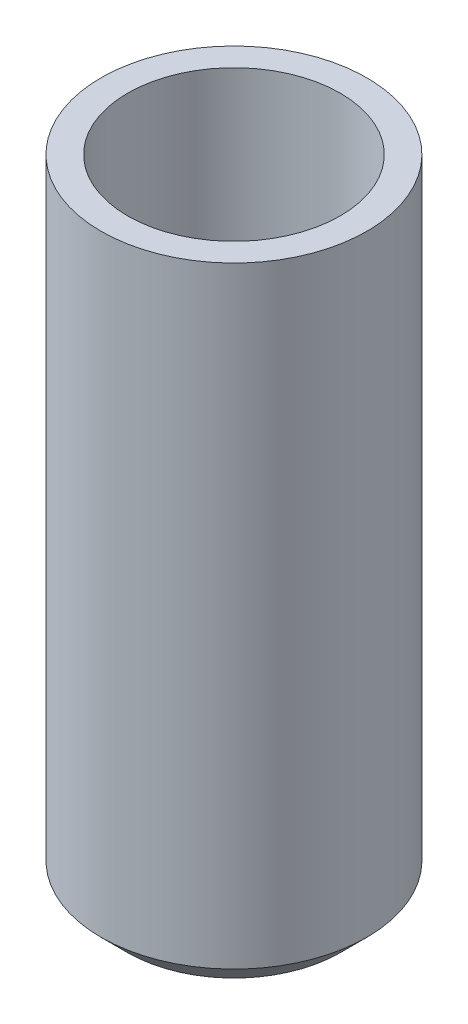
ISO-10303-21;
HEADER;
FILE_DESCRIPTION(('STEP AP214'),'2;1');
FILE_NAME('part.step','',(''),(''),'','','');
FILE_SCHEMA(('AUTOMOTIVE_DESIGN { 1 0 10303 214 1 1 1 1 }'));
ENDSEC;
DATA;
#1=APPLICATION_CONTEXT('core data for automotive mechanical design processes');
#2=APPLICATION_PROTOCOL_DEFINITION('international standard','automotive_design',2000,#1);
#3=PRODUCT_CONTEXT('',#1,'mechanical');
#4=PRODUCT('Part','Part','',(#3));
#5=PRODUCT_RELATED_PRODUCT_CATEGORY('part','',(#4));
#6=PRODUCT_DEFINITION_FORMATION('','',#4);
#7=PRODUCT_DEFINITION_CONTEXT('part definition',#1,'design');
#8=PRODUCT_DEFINITION('design','',#6,#7);
#9=PRODUCT_DEFINITION_SHAPE('','',#8);
#10=(LENGTH_UNIT() NAMED_UNIT(*) SI_UNIT(.MILLI.,.METRE.));
#11=(NAMED_UNIT(*) PLANE_ANGLE_UNIT() SI_UNIT($,.RADIAN.));
#12=(NAMED_UNIT(*) SI_UNIT($,.STERADIAN.) SOLID_ANGLE_UNIT());
#13=UNCERTAINTY_MEASURE_WITH_UNIT(LENGTH_MEASURE(1.E-05),#10,'distance_accuracy_value','');
#14=(GEOMETRIC_REPRESENTATION_CONTEXT(3) GLOBAL_UNCERTAINTY_ASSIGNED_CONTEXT((#13)) GLOBAL_UNIT_ASSIGNED_CONTEXT((#10,
#11,#12)) REPRESENTATION_CONTEXT('',''));
#15=CARTESIAN_POINT('',(0.,0.,0.));
#16=DIRECTION('',(0.,0.,1.));
#17=DIRECTION('',(1.,0.,0.));
#18=AXIS2_PLACEMENT_3D('',#15,#16,#17);
#19=CARTESIAN_POINT('',(0.,0.,0.));
#20=DIRECTION('',(0.,1.,0.));
#21=DIRECTION('',(0.,0.,1.));
#22=AXIS2_PLACEMENT_3D('',#19,#20,#21);
#23=PLANE('',#22);
#24=CARTESIAN_POINT('',(0.,0.,0.));
#25=DIRECTION('',(0.,1.,0.));
#26=DIRECTION('',(0.,0.,1.));
#27=AXIS2_PLACEMENT_3D('',#24,#25,#26);
#28=CIRCLE('',#27,2.00000000000002);
#29=CARTESIAN_POINT('',(0.,0.,2.00000000000002));
#30=VERTEX_POINT('',#29);
#31=EDGE_CURVE('E10',#30,#30,#28,.T.);
#32=ORIENTED_EDGE('',*,*,#31,.F.);
#33=EDGE_LOOP('',(#32));
#34=FACE_BOUND('',#33,.T.);
#35=ADVANCED_FACE('F37',(#34),#23,.F.);
#36=CARTESIAN_POINT('',(0.,0.,0.));
#37=DIRECTION('',(0.,1.,0.));
#38=DIRECTION('',(0.,0.,1.));
#39=AXIS2_PLACEMENT_3D('',#36,#37,#38);
#40=CONICAL_SURFACE('',#39,2.00000000000002,0.785398163397446);
#41=CARTESIAN_POINT('',(0.,0.5,0.));
#42=DIRECTION('',(0.,1.,0.));
#43=DIRECTION('',(0.,0.,1.));
#44=AXIS2_PLACEMENT_3D('',#41,#42,#43);
#45=CIRCLE('',#44,2.50000000000002);
#46=CARTESIAN_POINT('',(0.,0.5,2.50000000000002));
#47=VERTEX_POINT('',#46);
#48=EDGE_CURVE('E44',#47,#47,#45,.T.);
#49=ORIENTED_EDGE('',*,*,#48,.F.);
#50=EDGE_LOOP('',(#49));
#51=FACE_BOUND('',#50,.T.);
#52=ORIENTED_EDGE('',*,*,#31,.T.);
#53=EDGE_LOOP('',(#52));
#54=FACE_BOUND('',#53,.T.);
#55=ADVANCED_FACE('F81',(#51,#54),#40,.T.);
#56=CARTESIAN_POINT('',(0.,120.774509803922,0.));
#57=DIRECTION('',(0.,1.,0.));
#58=DIRECTION('',(0.,0.,1.));
#59=AXIS2_PLACEMENT_3D('',#56,#57,#58);
#60=CYLINDRICAL_SURFACE('',#59,2.50000000000002);
#61=CARTESIAN_POINT('',(0.,12.,0.));
#62=DIRECTION('',(0.,1.,0.));
#63=DIRECTION('',(0.,0.,1.));
#64=AXIS2_PLACEMENT_3D('',#61,#62,#63);
#65=CIRCLE('',#64,2.50000000000001);
#66=CARTESIAN_POINT('',(0.,12.,2.50000000000001));
#67=VERTEX_POINT('',#66);
#68=EDGE_CURVE('E49',#67,#67,#65,.T.);
#69=ORIENTED_EDGE('',*,*,#68,.F.);
#70=EDGE_LOOP('',(#69));
#71=FACE_BOUND('',#70,.T.);
#72=ORIENTED_EDGE('',*,*,#48,.T.);
#73=EDGE_LOOP('',(#72));
#74=FACE_BOUND('',#73,.T.);
#75=ADVANCED_FACE('F76',(#71,#74),#60,.T.);
#76=CARTESIAN_POINT('',(2.50000000000001,12.,0.));
#77=DIRECTION('',(0.,-1.,0.));
#78=DIRECTION('',(0.,0.,-1.));
#79=AXIS2_PLACEMENT_3D('',#76,#77,#78);
#80=PLANE('',#79);
#81=CARTESIAN_POINT('',(0.,12.,0.));
#82=DIRECTION('',(0.,1.,0.));
#83=DIRECTION('',(0.,0.,1.));
#84=AXIS2_PLACEMENT_3D('',#81,#82,#83);
#85=CIRCLE('',#84,2.);
#86=CARTESIAN_POINT('',(0.,12.,2.));
#87=VERTEX_POINT('',#86);
#88=EDGE_CURVE('E57',#87,#87,#85,.T.);
#89=ORIENTED_EDGE('',*,*,#88,.F.);
#90=EDGE_LOOP('',(#89));
#91=FACE_BOUND('',#90,.T.);
#92=ORIENTED_EDGE('',*,*,#68,.T.);
#93=EDGE_LOOP('',(#92));
#94=FACE_BOUND('',#93,.T.);
#95=ADVANCED_FACE('F70',(#91,#94),#80,.F.);
#96=CARTESIAN_POINT('',(0.,4.,0.));
#97=DIRECTION('',(0.,1.,0.));
#98=DIRECTION('',(0.,0.,1.));
#99=AXIS2_PLACEMENT_3D('',#96,#97,#98);
#100=CYLINDRICAL_SURFACE('',#99,2.);
#101=CARTESIAN_POINT('',(0.,4.,0.));
#102=DIRECTION('',(0.,1.,0.));
#103=DIRECTION('',(0.,0.,1.));
#104=AXIS2_PLACEMENT_3D('',#101,#102,#103);
#105=CIRCLE('',#104,2.);
#106=CARTESIAN_POINT('',(0.,4.,2.));
#107=VERTEX_POINT('',#106);
#108=EDGE_CURVE('E54',#107,#107,#105,.T.);
#109=ORIENTED_EDGE('',*,*,#108,.F.);
#110=EDGE_LOOP('',(#109));
#111=FACE_BOUND('',#110,.T.);
#112=ORIENTED_EDGE('',*,*,#88,.T.);
#113=EDGE_LOOP('',(#112));
#114=FACE_BOUND('',#113,.T.);
#115=ADVANCED_FACE('F67',(#111,#114),#100,.F.);
#116=CARTESIAN_POINT('',(0.,4.,0.));
#117=DIRECTION('',(0.,1.,0.));
#118=DIRECTION('',(0.,0.,1.));
#119=AXIS2_PLACEMENT_3D('',#116,#117,#118);
#120=PLANE('',#119);
#121=ORIENTED_EDGE('',*,*,#108,.T.);
#122=EDGE_LOOP('',(#121));
#123=FACE_BOUND('',#122,.T.);
#124=ADVANCED_FACE('F65',(#123),#120,.T.);
#125=CLOSED_SHELL('',(#35,#55,#75,#95,#115,#124));
#126=MANIFOLD_SOLID_BREP('B2',#125);
#127=ADVANCED_BREP_SHAPE_REPRESENTATION('',(#18,#126),#14);
#128=SHAPE_DEFINITION_REPRESENTATION(#9,#127);
ENDSEC;
END-ISO-10303-21;
